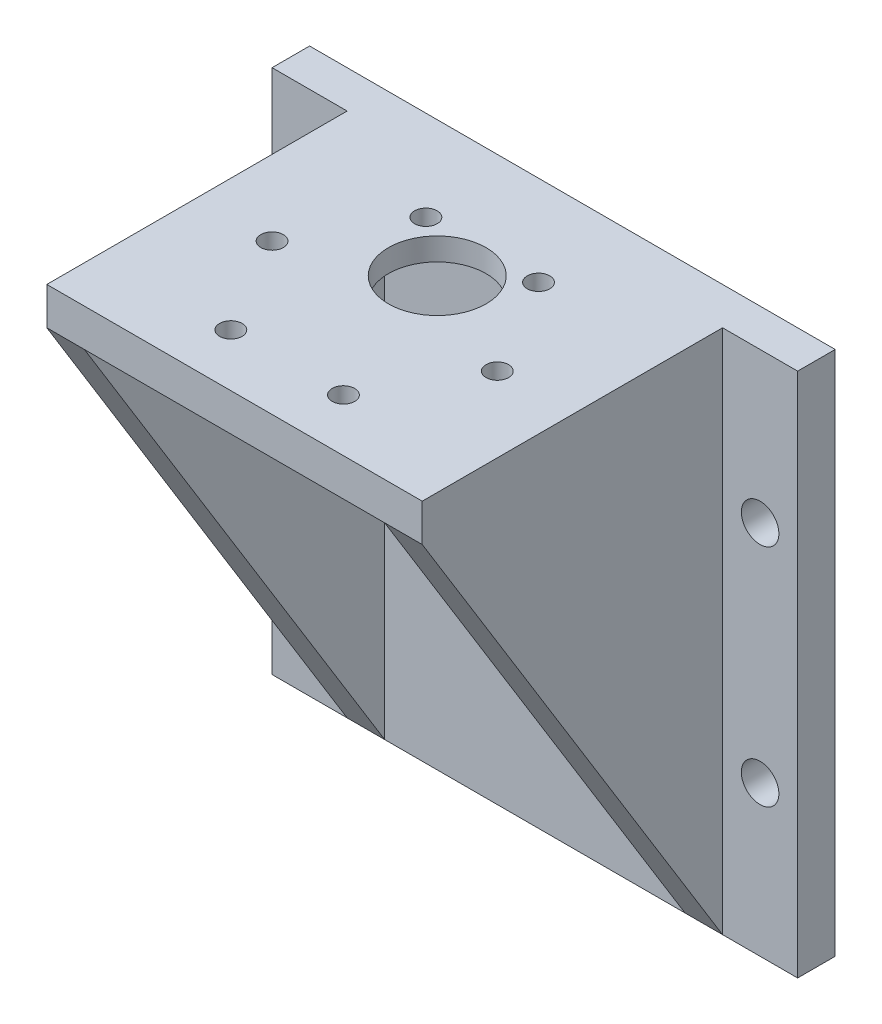
ISO-10303-21;
HEADER;
FILE_DESCRIPTION(('STEP AP214'),'2;1');
FILE_NAME('part.step','',(''),(''),'','','');
FILE_SCHEMA(('AUTOMOTIVE_DESIGN { 1 0 10303 214 1 1 1 1 }'));
ENDSEC;
DATA;
#1=APPLICATION_CONTEXT('core data for automotive mechanical design processes');
#2=APPLICATION_PROTOCOL_DEFINITION('international standard','automotive_design',2000,#1);
#3=PRODUCT_CONTEXT('',#1,'mechanical');
#4=PRODUCT('Part','Part','',(#3));
#5=PRODUCT_RELATED_PRODUCT_CATEGORY('part','',(#4));
#6=PRODUCT_DEFINITION_FORMATION('','',#4);
#7=PRODUCT_DEFINITION_CONTEXT('part definition',#1,'design');
#8=PRODUCT_DEFINITION('design','',#6,#7);
#9=PRODUCT_DEFINITION_SHAPE('','',#8);
#10=(LENGTH_UNIT() NAMED_UNIT(*) SI_UNIT(.MILLI.,.METRE.));
#11=(NAMED_UNIT(*) PLANE_ANGLE_UNIT() SI_UNIT($,.RADIAN.));
#12=(NAMED_UNIT(*) SI_UNIT($,.STERADIAN.) SOLID_ANGLE_UNIT());
#13=UNCERTAINTY_MEASURE_WITH_UNIT(LENGTH_MEASURE(1.E-05),#10,'distance_accuracy_value','');
#14=(GEOMETRIC_REPRESENTATION_CONTEXT(3) GLOBAL_UNCERTAINTY_ASSIGNED_CONTEXT((#13)) GLOBAL_UNIT_ASSIGNED_CONTEXT((#10,
#11,#12)) REPRESENTATION_CONTEXT('',''));
#15=CARTESIAN_POINT('',(0.,0.,0.));
#16=DIRECTION('',(0.,0.,1.));
#17=DIRECTION('',(1.,0.,0.));
#18=AXIS2_PLACEMENT_3D('',#15,#16,#17);
#19=CARTESIAN_POINT('',(0.,0.,5.));
#20=DIRECTION('',(0.,0.,1.));
#21=DIRECTION('',(1.,0.,0.));
#22=AXIS2_PLACEMENT_3D('',#19,#20,#21);
#23=PLANE('',#22);
#24=CARTESIAN_POINT('',(-41.7148673452362,-16.7230769230769,5.));
#25=DIRECTION('',(0.,0.,1.));
#26=DIRECTION('',(1.,0.,0.));
#27=AXIS2_PLACEMENT_3D('',#24,#25,#26);
#28=CIRCLE('',#27,2.49999999999999);
#29=CARTESIAN_POINT('',(-39.2148673452362,-16.7230769230769,5.));
#30=VERTEX_POINT('',#29);
#31=EDGE_CURVE('E187',#30,#30,#28,.T.);
#32=ORIENTED_EDGE('',*,*,#31,.F.);
#33=EDGE_LOOP('',(#32));
#34=FACE_BOUND('',#33,.T.);
#35=CARTESIAN_POINT('',(-41.7148673452362,13.2769230769231,5.));
#36=DIRECTION('',(0.,0.,1.));
#37=DIRECTION('',(1.,0.,0.));
#38=AXIS2_PLACEMENT_3D('',#35,#36,#37);
#39=CIRCLE('',#38,2.5);
#40=CARTESIAN_POINT('',(-39.2148673452362,13.2769230769231,5.));
#41=VERTEX_POINT('',#40);
#42=EDGE_CURVE('E181',#41,#41,#39,.T.);
#43=ORIENTED_EDGE('',*,*,#42,.F.);
#44=EDGE_LOOP('',(#43));
#45=FACE_BOUND('',#44,.T.);
#46=DIRECTION('',(0.,-1.,0.));
#47=VECTOR('',#46,1.);
#48=CARTESIAN_POINT('',(-36.7148673452362,-36.7230769230769,5.));
#49=LINE('',#48,#47);
#50=CARTESIAN_POINT('',(-36.7148673452362,33.2769230769231,5.));
#51=VERTEX_POINT('',#50);
#52=CARTESIAN_POINT('',(-36.7148673452362,-36.7230769230769,5.00000000000001));
#53=VERTEX_POINT('',#52);
#54=EDGE_CURVE('E133',#51,#53,#49,.T.);
#55=ORIENTED_EDGE('',*,*,#54,.F.);
#56=DIRECTION('',(-1.,0.,0.));
#57=VECTOR('',#56,1.);
#58=CARTESIAN_POINT('',(-46.7148673452362,33.2769230769231,5.));
#59=LINE('',#58,#57);
#60=CARTESIAN_POINT('',(-46.7148673452362,33.2769230769231,5.));
#61=VERTEX_POINT('',#60);
#62=EDGE_CURVE('E338',#51,#61,#59,.T.);
#63=ORIENTED_EDGE('',*,*,#62,.T.);
#64=DIRECTION('',(0.,-1.,0.));
#65=VECTOR('',#64,1.);
#66=CARTESIAN_POINT('',(-46.7148673452362,33.2769230769231,5.));
#67=LINE('',#66,#65);
#68=CARTESIAN_POINT('',(-46.7148673452361,-36.7230769230769,5.));
#69=VERTEX_POINT('',#68);
#70=EDGE_CURVE('E300',#61,#69,#67,.T.);
#71=ORIENTED_EDGE('',*,*,#70,.T.);
#72=DIRECTION('',(1.,0.,0.));
#73=VECTOR('',#72,1.);
#74=CARTESIAN_POINT('',(-46.7148673452361,-36.7230769230769,5.));
#75=LINE('',#74,#73);
#76=EDGE_CURVE('E315',#69,#53,#75,.T.);
#77=ORIENTED_EDGE('',*,*,#76,.T.);
#78=EDGE_LOOP('',(#55,#63,#71,#77));
#79=FACE_BOUND('',#78,.T.);
#80=ADVANCED_FACE('F33',(#34,#45,#79),#23,.T.);
#81=CARTESIAN_POINT('',(18.2851326547639,13.2769230769231,5.));
#82=DIRECTION('',(0.,0.,1.));
#83=DIRECTION('',(1.,0.,0.));
#84=AXIS2_PLACEMENT_3D('',#81,#82,#83);
#85=CIRCLE('',#84,2.5);
#86=CARTESIAN_POINT('',(20.7851326547639,13.2769230769231,5.));
#87=VERTEX_POINT('',#86);
#88=EDGE_CURVE('E199',#87,#87,#85,.T.);
#89=ORIENTED_EDGE('',*,*,#88,.F.);
#90=EDGE_LOOP('',(#89));
#91=FACE_BOUND('',#90,.T.);
#92=CARTESIAN_POINT('',(18.2851326547639,-16.7230769230769,5.));
#93=DIRECTION('',(0.,0.,1.));
#94=DIRECTION('',(1.,0.,0.));
#95=AXIS2_PLACEMENT_3D('',#92,#93,#94);
#96=CIRCLE('',#95,2.5);
#97=CARTESIAN_POINT('',(20.7851326547639,-16.7230769230769,5.));
#98=VERTEX_POINT('',#97);
#99=EDGE_CURVE('E193',#98,#98,#96,.T.);
#100=ORIENTED_EDGE('',*,*,#99,.F.);
#101=EDGE_LOOP('',(#100));
#102=FACE_BOUND('',#101,.T.);
#103=DIRECTION('',(0.,1.,0.));
#104=VECTOR('',#103,1.);
#105=CARTESIAN_POINT('',(13.2851326547639,33.2769230769231,5.));
#106=LINE('',#105,#104);
#107=CARTESIAN_POINT('',(13.2851326547639,-36.7230769230769,5.00000000000001));
#108=VERTEX_POINT('',#107);
#109=CARTESIAN_POINT('',(13.2851326547639,33.2769230769231,5.));
#110=VERTEX_POINT('',#109);
#111=EDGE_CURVE('E157',#108,#110,#106,.T.);
#112=ORIENTED_EDGE('',*,*,#111,.F.);
#113=CARTESIAN_POINT('',(23.2851326547639,-36.7230769230769,5.));
#114=VERTEX_POINT('',#113);
#115=EDGE_CURVE('E303',#108,#114,#75,.T.);
#116=ORIENTED_EDGE('',*,*,#115,.T.);
#117=DIRECTION('',(0.,1.,0.));
#118=VECTOR('',#117,1.);
#119=CARTESIAN_POINT('',(23.2851326547639,33.2769230769231,5.));
#120=LINE('',#119,#118);
#121=CARTESIAN_POINT('',(23.2851326547639,33.2769230769231,5.));
#122=VERTEX_POINT('',#121);
#123=EDGE_CURVE('E307',#114,#122,#120,.T.);
#124=ORIENTED_EDGE('',*,*,#123,.T.);
#125=EDGE_CURVE('E339',#122,#110,#59,.T.);
#126=ORIENTED_EDGE('',*,*,#125,.T.);
#127=EDGE_LOOP('',(#112,#116,#124,#126));
#128=FACE_BOUND('',#127,.T.);
#129=ADVANCED_FACE('F323',(#91,#102,#128),#23,.T.);
#130=CARTESIAN_POINT('',(-46.7148673452362,33.2769230769231,5.));
#131=DIRECTION('',(1.,0.,0.));
#132=DIRECTION('',(0.,1.,0.));
#133=AXIS2_PLACEMENT_3D('',#130,#131,#132);
#134=PLANE('',#133);
#135=DIRECTION('',(0.,-1.,0.));
#136=VECTOR('',#135,1.);
#137=CARTESIAN_POINT('',(-46.7148673452362,33.2769230769231,0.));
#138=LINE('',#137,#136);
#139=CARTESIAN_POINT('',(-46.7148673452362,33.2769230769231,0.));
#140=VERTEX_POINT('',#139);
#141=CARTESIAN_POINT('',(-46.7148673452361,-36.7230769230769,0.));
#142=VERTEX_POINT('',#141);
#143=EDGE_CURVE('E295',#140,#142,#138,.T.);
#144=ORIENTED_EDGE('',*,*,#143,.T.);
#145=DIRECTION('',(0.,0.,-1.));
#146=VECTOR('',#145,1.);
#147=CARTESIAN_POINT('',(-46.7148673452361,-36.7230769230769,5.));
#148=LINE('',#147,#146);
#149=EDGE_CURVE('E42',#69,#142,#148,.T.);
#150=ORIENTED_EDGE('',*,*,#149,.F.);
#151=ORIENTED_EDGE('',*,*,#70,.F.);
#152=DIRECTION('',(0.,0.,-1.));
#153=VECTOR('',#152,1.);
#154=CARTESIAN_POINT('',(-46.7148673452362,33.2769230769231,5.));
#155=LINE('',#154,#153);
#156=EDGE_CURVE('E344',#61,#140,#155,.T.);
#157=ORIENTED_EDGE('',*,*,#156,.T.);
#158=EDGE_LOOP('',(#144,#150,#151,#157));
#159=FACE_BOUND('',#158,.T.);
#160=ADVANCED_FACE('F35',(#159),#134,.F.);
#161=CARTESIAN_POINT('',(-46.7148673452361,-36.7230769230769,5.));
#162=DIRECTION('',(0.,1.,0.));
#163=DIRECTION('',(0.,0.,1.));
#164=AXIS2_PLACEMENT_3D('',#161,#162,#163);
#165=PLANE('',#164);
#166=ORIENTED_EDGE('',*,*,#115,.F.);
#167=DIRECTION('',(-1.,0.,0.));
#168=VECTOR('',#167,1.);
#169=CARTESIAN_POINT('',(89.6068202671326,-36.7230769230769,5.00000000000001));
#170=LINE('',#169,#168);
#171=CARTESIAN_POINT('',(8.28513265476387,-36.7230769230769,5.00000000000001));
#172=VERTEX_POINT('',#171);
#173=EDGE_CURVE('E163',#108,#172,#170,.T.);
#174=ORIENTED_EDGE('',*,*,#173,.T.);
#175=CARTESIAN_POINT('',(-31.7148673452362,-36.7230769230769,5.00000000000001));
#176=VERTEX_POINT('',#175);
#177=EDGE_CURVE('E318',#176,#172,#75,.T.);
#178=ORIENTED_EDGE('',*,*,#177,.F.);
#179=EDGE_CURVE('E168',#176,#53,#170,.T.);
#180=ORIENTED_EDGE('',*,*,#179,.T.);
#181=ORIENTED_EDGE('',*,*,#76,.F.);
#182=ORIENTED_EDGE('',*,*,#149,.T.);
#183=DIRECTION('',(1.,0.,0.));
#184=VECTOR('',#183,1.);
#185=CARTESIAN_POINT('',(-46.7148673452361,-36.7230769230769,0.));
#186=LINE('',#185,#184);
#187=CARTESIAN_POINT('',(23.2851326547639,-36.7230769230769,0.));
#188=VERTEX_POINT('',#187);
#189=EDGE_CURVE('E331',#142,#188,#186,.T.);
#190=ORIENTED_EDGE('',*,*,#189,.T.);
#191=DIRECTION('',(0.,0.,-1.));
#192=VECTOR('',#191,1.);
#193=CARTESIAN_POINT('',(23.2851326547639,-36.7230769230769,5.));
#194=LINE('',#193,#192);
#195=EDGE_CURVE('E328',#114,#188,#194,.T.);
#196=ORIENTED_EDGE('',*,*,#195,.F.);
#197=EDGE_LOOP('',(#166,#174,#178,#180,#181,#182,#190,#196));
#198=FACE_BOUND('',#197,.T.);
#199=ADVANCED_FACE('F329',(#198),#165,.F.);
#200=CARTESIAN_POINT('',(23.2851326547639,33.2769230769231,5.));
#201=DIRECTION('',(-1.,0.,0.));
#202=DIRECTION('',(0.,-1.,0.));
#203=AXIS2_PLACEMENT_3D('',#200,#201,#202);
#204=PLANE('',#203);
#205=DIRECTION('',(0.,1.,0.));
#206=VECTOR('',#205,1.);
#207=CARTESIAN_POINT('',(23.2851326547639,33.2769230769231,0.));
#208=LINE('',#207,#206);
#209=CARTESIAN_POINT('',(23.2851326547639,33.2769230769231,0.));
#210=VERTEX_POINT('',#209);
#211=EDGE_CURVE('E353',#188,#210,#208,.T.);
#212=ORIENTED_EDGE('',*,*,#211,.T.);
#213=DIRECTION('',(0.,0.,-1.));
#214=VECTOR('',#213,1.);
#215=CARTESIAN_POINT('',(23.2851326547639,33.2769230769231,5.));
#216=LINE('',#215,#214);
#217=EDGE_CURVE('E334',#122,#210,#216,.T.);
#218=ORIENTED_EDGE('',*,*,#217,.F.);
#219=ORIENTED_EDGE('',*,*,#123,.F.);
#220=ORIENTED_EDGE('',*,*,#195,.T.);
#221=EDGE_LOOP('',(#212,#218,#219,#220));
#222=FACE_BOUND('',#221,.T.);
#223=ADVANCED_FACE('F335',(#222),#204,.F.);
#224=CARTESIAN_POINT('',(-46.7148673452362,33.2769230769231,5.));
#225=DIRECTION('',(0.,-1.,0.));
#226=DIRECTION('',(0.,0.,-1.));
#227=AXIS2_PLACEMENT_3D('',#224,#225,#226);
#228=PLANE('',#227);
#229=CARTESIAN_POINT('',(-19.2148673452363,33.2769230769231,37.9903810567665));
#230=DIRECTION('',(0.,-1.,0.));
#231=DIRECTION('',(0.,0.,-1.));
#232=AXIS2_PLACEMENT_3D('',#229,#230,#231);
#233=CIRCLE('',#232,1.5);
#234=CARTESIAN_POINT('',(-19.2148673452363,33.2769230769231,36.4903810567665));
#235=VERTEX_POINT('',#234);
#236=EDGE_CURVE('E244',#235,#235,#233,.F.);
#237=ORIENTED_EDGE('',*,*,#236,.F.);
#238=EDGE_LOOP('',(#237));
#239=FACE_BOUND('',#238,.T.);
#240=CARTESIAN_POINT('',(-4.21486734523628,33.2769230769231,37.9903810567667));
#241=DIRECTION('',(0.,-1.,0.));
#242=DIRECTION('',(0.,0.,-1.));
#243=AXIS2_PLACEMENT_3D('',#240,#241,#242);
#244=CIRCLE('',#243,1.5);
#245=CARTESIAN_POINT('',(-4.21486734523628,33.2769230769231,36.4903810567667));
#246=VERTEX_POINT('',#245);
#247=EDGE_CURVE('E238',#246,#246,#244,.F.);
#248=ORIENTED_EDGE('',*,*,#247,.F.);
#249=EDGE_LOOP('',(#248));
#250=FACE_BOUND('',#249,.T.);
#251=CARTESIAN_POINT('',(3.28513265476384,33.2769230769231,25.));
#252=DIRECTION('',(0.,-1.,0.));
#253=DIRECTION('',(0.,0.,-1.));
#254=AXIS2_PLACEMENT_3D('',#251,#252,#253);
#255=CIRCLE('',#254,1.5);
#256=CARTESIAN_POINT('',(3.28513265476384,33.2769230769231,23.5));
#257=VERTEX_POINT('',#256);
#258=EDGE_CURVE('E232',#257,#257,#255,.F.);
#259=ORIENTED_EDGE('',*,*,#258,.F.);
#260=EDGE_LOOP('',(#259));
#261=FACE_BOUND('',#260,.T.);
#262=CARTESIAN_POINT('',(-4.2148673452361,33.2769230769231,12.0096189432334));
#263=DIRECTION('',(0.,-1.,0.));
#264=DIRECTION('',(0.,0.,-1.));
#265=AXIS2_PLACEMENT_3D('',#262,#263,#264);
#266=CIRCLE('',#265,1.5);
#267=CARTESIAN_POINT('',(-4.2148673452361,33.2769230769231,10.5096189432334));
#268=VERTEX_POINT('',#267);
#269=EDGE_CURVE('E226',#268,#268,#266,.F.);
#270=ORIENTED_EDGE('',*,*,#269,.F.);
#271=EDGE_LOOP('',(#270));
#272=FACE_BOUND('',#271,.T.);
#273=CARTESIAN_POINT('',(-19.2148673452361,33.2769230769231,12.0096189432334));
#274=DIRECTION('',(0.,-1.,0.));
#275=DIRECTION('',(0.,0.,-1.));
#276=AXIS2_PLACEMENT_3D('',#273,#274,#275);
#277=CIRCLE('',#276,1.5);
#278=CARTESIAN_POINT('',(-19.2148673452361,33.2769230769231,10.5096189432334));
#279=VERTEX_POINT('',#278);
#280=EDGE_CURVE('E220',#279,#279,#277,.F.);
#281=ORIENTED_EDGE('',*,*,#280,.F.);
#282=EDGE_LOOP('',(#281));
#283=FACE_BOUND('',#282,.T.);
#284=CARTESIAN_POINT('',(-26.7148673452362,33.2769230769231,25.));
#285=DIRECTION('',(0.,-1.,0.));
#286=DIRECTION('',(0.,0.,-1.));
#287=AXIS2_PLACEMENT_3D('',#284,#285,#286);
#288=CIRCLE('',#287,1.5);
#289=CARTESIAN_POINT('',(-26.7148673452362,33.2769230769231,23.5));
#290=VERTEX_POINT('',#289);
#291=EDGE_CURVE('E214',#290,#290,#288,.F.);
#292=ORIENTED_EDGE('',*,*,#291,.F.);
#293=EDGE_LOOP('',(#292));
#294=FACE_BOUND('',#293,.T.);
#295=CARTESIAN_POINT('',(-11.7148673452362,33.2769230769231,18.));
#296=DIRECTION('',(0.,-1.,0.));
#297=DIRECTION('',(0.,0.,-1.));
#298=AXIS2_PLACEMENT_3D('',#295,#296,#297);
#299=CIRCLE('',#298,6.5);
#300=CARTESIAN_POINT('',(-11.7148673452362,33.2769230769231,11.5));
#301=VERTEX_POINT('',#300);
#302=EDGE_CURVE('E206',#301,#301,#299,.F.);
#303=ORIENTED_EDGE('',*,*,#302,.F.);
#304=EDGE_LOOP('',(#303));
#305=FACE_BOUND('',#304,.T.);
#306=DIRECTION('',(-1.,0.,0.));
#307=VECTOR('',#306,1.);
#308=CARTESIAN_POINT('',(-46.7148673452362,33.2769230769231,0.));
#309=LINE('',#308,#307);
#310=EDGE_CURVE('E304',#210,#140,#309,.T.);
#311=ORIENTED_EDGE('',*,*,#310,.T.);
#312=ORIENTED_EDGE('',*,*,#156,.F.);
#313=ORIENTED_EDGE('',*,*,#62,.F.);
#314=DIRECTION('',(0.,0.,-1.));
#315=VECTOR('',#314,1.);
#316=CARTESIAN_POINT('',(-36.7148673452362,33.2769230769231,45.));
#317=LINE('',#316,#315);
#318=CARTESIAN_POINT('',(-36.7148673452362,33.2769230769231,45.));
#319=VERTEX_POINT('',#318);
#320=EDGE_CURVE('E140',#319,#51,#317,.T.);
#321=ORIENTED_EDGE('',*,*,#320,.F.);
#322=DIRECTION('',(-1.,0.,0.));
#323=VECTOR('',#322,1.);
#324=CARTESIAN_POINT('',(-36.7148673452362,33.2769230769231,45.));
#325=LINE('',#324,#323);
#326=CARTESIAN_POINT('',(13.2851326547639,33.2769230769231,45.));
#327=VERTEX_POINT('',#326);
#328=EDGE_CURVE('E138',#327,#319,#325,.T.);
#329=ORIENTED_EDGE('',*,*,#328,.F.);
#330=DIRECTION('',(0.,0.,-1.));
#331=VECTOR('',#330,1.);
#332=CARTESIAN_POINT('',(13.2851326547639,33.2769230769231,45.));
#333=LINE('',#332,#331);
#334=EDGE_CURVE('E142',#327,#110,#333,.T.);
#335=ORIENTED_EDGE('',*,*,#334,.T.);
#336=ORIENTED_EDGE('',*,*,#125,.F.);
#337=ORIENTED_EDGE('',*,*,#217,.T.);
#338=EDGE_LOOP('',(#311,#312,#313,#321,#329,#335,#336,#337));
#339=FACE_BOUND('',#338,.T.);
#340=ADVANCED_FACE('F360',(#239,#250,#261,#272,#283,#294,#305,#339),#228,.F.);
#341=DIRECTION('',(0.,-1.,0.));
#342=VECTOR('',#341,1.);
#343=CARTESIAN_POINT('',(8.28513265476387,-36.7230769230769,5.));
#344=LINE('',#343,#342);
#345=CARTESIAN_POINT('',(8.28513265476387,28.2769230769231,5.));
#346=VERTEX_POINT('',#345);
#347=EDGE_CURVE('E58',#346,#172,#344,.T.);
#348=ORIENTED_EDGE('',*,*,#347,.F.);
#349=DIRECTION('',(1.,0.,0.));
#350=VECTOR('',#349,1.);
#351=CARTESIAN_POINT('',(8.28513265476387,28.2769230769231,5.));
#352=LINE('',#351,#350);
#353=CARTESIAN_POINT('',(-31.7148673452362,28.2769230769231,5.));
#354=VERTEX_POINT('',#353);
#355=EDGE_CURVE('E148',#354,#346,#352,.T.);
#356=ORIENTED_EDGE('',*,*,#355,.F.);
#357=DIRECTION('',(0.,1.,0.));
#358=VECTOR('',#357,1.);
#359=CARTESIAN_POINT('',(-31.7148673452362,28.2769230769231,5.));
#360=LINE('',#359,#358);
#361=EDGE_CURVE('E150',#176,#354,#360,.T.);
#362=ORIENTED_EDGE('',*,*,#361,.F.);
#363=ORIENTED_EDGE('',*,*,#177,.T.);
#364=EDGE_LOOP('',(#348,#356,#362,#363));
#365=FACE_BOUND('',#364,.T.);
#366=ADVANCED_FACE('F384',(#365),#23,.T.);
#367=CARTESIAN_POINT('',(0.,0.,0.));
#368=DIRECTION('',(0.,0.,1.));
#369=DIRECTION('',(1.,0.,0.));
#370=AXIS2_PLACEMENT_3D('',#367,#368,#369);
#371=PLANE('',#370);
#372=CARTESIAN_POINT('',(18.2851326547639,13.2769230769231,0.));
#373=DIRECTION('',(0.,0.,1.));
#374=DIRECTION('',(1.,0.,0.));
#375=AXIS2_PLACEMENT_3D('',#372,#373,#374);
#376=CIRCLE('',#375,2.5);
#377=CARTESIAN_POINT('',(20.7851326547639,13.2769230769231,0.));
#378=VERTEX_POINT('',#377);
#379=EDGE_CURVE('E196',#378,#378,#376,.F.);
#380=ORIENTED_EDGE('',*,*,#379,.F.);
#381=EDGE_LOOP('',(#380));
#382=FACE_BOUND('',#381,.T.);
#383=CARTESIAN_POINT('',(18.2851326547639,-16.7230769230769,0.));
#384=DIRECTION('',(0.,0.,1.));
#385=DIRECTION('',(1.,0.,0.));
#386=AXIS2_PLACEMENT_3D('',#383,#384,#385);
#387=CIRCLE('',#386,2.5);
#388=CARTESIAN_POINT('',(20.7851326547639,-16.7230769230769,0.));
#389=VERTEX_POINT('',#388);
#390=EDGE_CURVE('E190',#389,#389,#387,.F.);
#391=ORIENTED_EDGE('',*,*,#390,.F.);
#392=EDGE_LOOP('',(#391));
#393=FACE_BOUND('',#392,.T.);
#394=CARTESIAN_POINT('',(-41.7148673452362,-16.7230769230769,0.));
#395=DIRECTION('',(0.,0.,1.));
#396=DIRECTION('',(1.,0.,0.));
#397=AXIS2_PLACEMENT_3D('',#394,#395,#396);
#398=CIRCLE('',#397,2.49999999999999);
#399=CARTESIAN_POINT('',(-39.2148673452362,-16.7230769230769,0.));
#400=VERTEX_POINT('',#399);
#401=EDGE_CURVE('E184',#400,#400,#398,.F.);
#402=ORIENTED_EDGE('',*,*,#401,.F.);
#403=EDGE_LOOP('',(#402));
#404=FACE_BOUND('',#403,.T.);
#405=CARTESIAN_POINT('',(-41.7148673452362,13.2769230769231,0.));
#406=DIRECTION('',(0.,0.,1.));
#407=DIRECTION('',(1.,0.,0.));
#408=AXIS2_PLACEMENT_3D('',#405,#406,#407);
#409=CIRCLE('',#408,2.5);
#410=CARTESIAN_POINT('',(-39.2148673452362,13.2769230769231,0.));
#411=VERTEX_POINT('',#410);
#412=EDGE_CURVE('E135',#411,#411,#409,.F.);
#413=ORIENTED_EDGE('',*,*,#412,.F.);
#414=EDGE_LOOP('',(#413));
#415=FACE_BOUND('',#414,.T.);
#416=ORIENTED_EDGE('',*,*,#143,.F.);
#417=ORIENTED_EDGE('',*,*,#310,.F.);
#418=ORIENTED_EDGE('',*,*,#211,.F.);
#419=ORIENTED_EDGE('',*,*,#189,.F.);
#420=EDGE_LOOP('',(#416,#417,#418,#419));
#421=FACE_BOUND('',#420,.T.);
#422=ADVANCED_FACE('F363',(#382,#393,#404,#415,#421),#371,.F.);
#423=CARTESIAN_POINT('',(-31.7148673452362,28.2769230769231,45.));
#424=DIRECTION('',(-1.,0.,0.));
#425=DIRECTION('',(0.,-1.,0.));
#426=AXIS2_PLACEMENT_3D('',#423,#424,#425);
#427=PLANE('',#426);
#428=DIRECTION('',(0.,0.,-1.));
#429=VECTOR('',#428,1.);
#430=CARTESIAN_POINT('',(-31.7148673452362,28.2769230769231,45.));
#431=LINE('',#430,#429);
#432=CARTESIAN_POINT('',(-31.7148673452362,28.2769230769231,45.));
#433=VERTEX_POINT('',#432);
#434=EDGE_CURVE('E290',#433,#354,#431,.T.);
#435=ORIENTED_EDGE('',*,*,#434,.F.);
#436=DIRECTION('',(0.,-0.851658316704544,-0.524097425664335));
#437=VECTOR('',#436,1.);
#438=CARTESIAN_POINT('',(-31.7148673452362,28.2769230769231,45.));
#439=LINE('',#438,#437);
#440=EDGE_CURVE('E122',#433,#176,#439,.T.);
#441=ORIENTED_EDGE('',*,*,#440,.T.);
#442=ORIENTED_EDGE('',*,*,#361,.T.);
#443=EDGE_LOOP('',(#435,#441,#442));
#444=FACE_BOUND('',#443,.T.);
#445=ADVANCED_FACE('F283',(#444),#427,.F.);
#446=CARTESIAN_POINT('',(8.28513265476387,28.2769230769231,45.));
#447=DIRECTION('',(0.,1.,0.));
#448=DIRECTION('',(-1.,0.,0.));
#449=AXIS2_PLACEMENT_3D('',#446,#447,#448);
#450=PLANE('',#449);
#451=CARTESIAN_POINT('',(-11.7148673452362,28.2769230769231,25.));
#452=DIRECTION('',(0.,-1.,0.));
#453=DIRECTION('',(1.,0.,0.));
#454=AXIS2_PLACEMENT_3D('',#451,#452,#453);
#455=CIRCLE('',#454,19.);
#456=CARTESIAN_POINT('',(7.28513265476383,28.2769230769231,25.));
#457=VERTEX_POINT('',#456);
#458=EDGE_CURVE('E203',#457,#457,#455,.T.);
#459=ORIENTED_EDGE('',*,*,#458,.F.);
#460=EDGE_LOOP('',(#459));
#461=FACE_BOUND('',#460,.T.);
#462=ORIENTED_EDGE('',*,*,#355,.T.);
#463=DIRECTION('',(0.,0.,-1.));
#464=VECTOR('',#463,1.);
#465=CARTESIAN_POINT('',(8.28513265476387,28.2769230769231,45.));
#466=LINE('',#465,#464);
#467=CARTESIAN_POINT('',(8.28513265476387,28.2769230769231,45.));
#468=VERTEX_POINT('',#467);
#469=EDGE_CURVE('E289',#468,#346,#466,.T.);
#470=ORIENTED_EDGE('',*,*,#469,.F.);
#471=DIRECTION('',(1.,0.,0.));
#472=VECTOR('',#471,1.);
#473=CARTESIAN_POINT('',(8.28513265476387,28.2769230769231,45.));
#474=LINE('',#473,#472);
#475=EDGE_CURVE('E372',#433,#468,#474,.T.);
#476=ORIENTED_EDGE('',*,*,#475,.F.);
#477=ORIENTED_EDGE('',*,*,#434,.T.);
#478=EDGE_LOOP('',(#462,#470,#476,#477));
#479=FACE_BOUND('',#478,.T.);
#480=ADVANCED_FACE('F279',(#461,#479),#450,.F.);
#481=CARTESIAN_POINT('',(8.28513265476387,-36.7230769230769,45.));
#482=DIRECTION('',(1.,0.,0.));
#483=DIRECTION('',(0.,1.,0.));
#484=AXIS2_PLACEMENT_3D('',#481,#482,#483);
#485=PLANE('',#484);
#486=ORIENTED_EDGE('',*,*,#347,.T.);
#487=DIRECTION('',(0.,0.851658316704544,0.524097425664335));
#488=VECTOR('',#487,1.);
#489=CARTESIAN_POINT('',(8.28513265476387,-18.868999669858,15.9871244635193));
#490=LINE('',#489,#488);
#491=EDGE_CURVE('E162',#172,#468,#490,.T.);
#492=ORIENTED_EDGE('',*,*,#491,.T.);
#493=ORIENTED_EDGE('',*,*,#469,.T.);
#494=EDGE_LOOP('',(#486,#492,#493));
#495=FACE_BOUND('',#494,.T.);
#496=ADVANCED_FACE('F282',(#495),#485,.F.);
#497=CARTESIAN_POINT('',(13.2851326547639,33.2769230769231,45.));
#498=DIRECTION('',(-1.,0.,0.));
#499=DIRECTION('',(0.,-1.,0.));
#500=AXIS2_PLACEMENT_3D('',#497,#498,#499);
#501=PLANE('',#500);
#502=DIRECTION('',(0.,1.,0.));
#503=VECTOR('',#502,1.);
#504=CARTESIAN_POINT('',(13.2851326547639,33.2769230769231,45.));
#505=LINE('',#504,#503);
#506=CARTESIAN_POINT('',(13.2851326547639,28.2769230769231,45.));
#507=VERTEX_POINT('',#506);
#508=EDGE_CURVE('E144',#507,#327,#505,.T.);
#509=ORIENTED_EDGE('',*,*,#508,.F.);
#510=DIRECTION('',(0.,0.851658316704544,0.524097425664335));
#511=VECTOR('',#510,1.);
#512=CARTESIAN_POINT('',(13.2851326547639,28.2769230769231,45.));
#513=LINE('',#512,#511);
#514=EDGE_CURVE('E50',#108,#507,#513,.T.);
#515=ORIENTED_EDGE('',*,*,#514,.F.);
#516=ORIENTED_EDGE('',*,*,#111,.T.);
#517=ORIENTED_EDGE('',*,*,#334,.F.);
#518=EDGE_LOOP('',(#509,#515,#516,#517));
#519=FACE_BOUND('',#518,.T.);
#520=ADVANCED_FACE('F370',(#519),#501,.F.);
#521=CARTESIAN_POINT('',(-36.7148673452362,-36.7230769230769,45.));
#522=DIRECTION('',(1.,0.,0.));
#523=DIRECTION('',(0.,1.,0.));
#524=AXIS2_PLACEMENT_3D('',#521,#522,#523);
#525=PLANE('',#524);
#526=ORIENTED_EDGE('',*,*,#54,.T.);
#527=DIRECTION('',(0.,-0.851658316704544,-0.524097425664334));
#528=VECTOR('',#527,1.);
#529=CARTESIAN_POINT('',(-36.7148673452362,28.2769230769231,45.));
#530=LINE('',#529,#528);
#531=CARTESIAN_POINT('',(-36.7148673452362,28.2769230769231,45.));
#532=VERTEX_POINT('',#531);
#533=EDGE_CURVE('E119',#532,#53,#530,.T.);
#534=ORIENTED_EDGE('',*,*,#533,.F.);
#535=DIRECTION('',(0.,-1.,0.));
#536=VECTOR('',#535,1.);
#537=CARTESIAN_POINT('',(-36.7148673452362,-36.7230769230769,45.));
#538=LINE('',#537,#536);
#539=EDGE_CURVE('E132',#319,#532,#538,.T.);
#540=ORIENTED_EDGE('',*,*,#539,.F.);
#541=ORIENTED_EDGE('',*,*,#320,.T.);
#542=EDGE_LOOP('',(#526,#534,#540,#541));
#543=FACE_BOUND('',#542,.T.);
#544=ADVANCED_FACE('F130',(#543),#525,.F.);
#545=CARTESIAN_POINT('',(0.,0.,45.));
#546=DIRECTION('',(0.,0.,-1.));
#547=DIRECTION('',(-1.,0.,0.));
#548=AXIS2_PLACEMENT_3D('',#545,#546,#547);
#549=PLANE('',#548);
#550=ORIENTED_EDGE('',*,*,#539,.T.);
#551=DIRECTION('',(1.,0.,0.));
#552=VECTOR('',#551,1.);
#553=CARTESIAN_POINT('',(0.,28.2769230769231,45.));
#554=LINE('',#553,#552);
#555=EDGE_CURVE('E11',#532,#433,#554,.T.);
#556=ORIENTED_EDGE('',*,*,#555,.T.);
#557=ORIENTED_EDGE('',*,*,#475,.T.);
#558=DIRECTION('',(-1.,0.,0.));
#559=VECTOR('',#558,1.);
#560=CARTESIAN_POINT('',(89.6068202671326,28.2769230769231,45.));
#561=LINE('',#560,#559);
#562=EDGE_CURVE('E134',#507,#468,#561,.T.);
#563=ORIENTED_EDGE('',*,*,#562,.F.);
#564=ORIENTED_EDGE('',*,*,#508,.T.);
#565=ORIENTED_EDGE('',*,*,#328,.T.);
#566=EDGE_LOOP('',(#550,#556,#557,#563,#564,#565));
#567=FACE_BOUND('',#566,.T.);
#568=ADVANCED_FACE('F136',(#567),#549,.F.);
#569=CARTESIAN_POINT('',(89.6068202671326,28.2769230769231,45.));
#570=DIRECTION('',(0.,0.524097425664334,-0.851658316704544));
#571=DIRECTION('',(0.,0.851658316704544,0.524097425664335));
#572=AXIS2_PLACEMENT_3D('',#569,#570,#571);
#573=PLANE('',#572);
#574=ORIENTED_EDGE('',*,*,#173,.F.);
#575=ORIENTED_EDGE('',*,*,#514,.T.);
#576=ORIENTED_EDGE('',*,*,#562,.T.);
#577=ORIENTED_EDGE('',*,*,#491,.F.);
#578=EDGE_LOOP('',(#574,#575,#576,#577));
#579=FACE_BOUND('',#578,.T.);
#580=ADVANCED_FACE('F574',(#579),#573,.F.);
#581=ORIENTED_EDGE('',*,*,#555,.F.);
#582=ORIENTED_EDGE('',*,*,#533,.T.);
#583=ORIENTED_EDGE('',*,*,#179,.F.);
#584=ORIENTED_EDGE('',*,*,#440,.F.);
#585=EDGE_LOOP('',(#581,#582,#583,#584));
#586=FACE_BOUND('',#585,.T.);
#587=ADVANCED_FACE('F118',(#586),#573,.F.);
#588=CARTESIAN_POINT('',(-41.7148673452362,13.2769230769231,-7.07106781186548));
#589=DIRECTION('',(0.,0.,1.));
#590=DIRECTION('',(1.,0.,0.));
#591=AXIS2_PLACEMENT_3D('',#588,#589,#590);
#592=CYLINDRICAL_SURFACE('',#591,2.5);
#593=ORIENTED_EDGE('',*,*,#412,.T.);
#594=EDGE_LOOP('',(#593));
#595=FACE_BOUND('',#594,.T.);
#596=ORIENTED_EDGE('',*,*,#42,.T.);
#597=EDGE_LOOP('',(#596));
#598=FACE_BOUND('',#597,.T.);
#599=ADVANCED_FACE('F437',(#595,#598),#592,.F.);
#600=CARTESIAN_POINT('',(-41.7148673452362,-16.7230769230769,-7.07106781186548));
#601=DIRECTION('',(0.,0.,1.));
#602=DIRECTION('',(1.,0.,0.));
#603=AXIS2_PLACEMENT_3D('',#600,#601,#602);
#604=CYLINDRICAL_SURFACE('',#603,2.49999999999999);
#605=ORIENTED_EDGE('',*,*,#401,.T.);
#606=EDGE_LOOP('',(#605));
#607=FACE_BOUND('',#606,.T.);
#608=ORIENTED_EDGE('',*,*,#31,.T.);
#609=EDGE_LOOP('',(#608));
#610=FACE_BOUND('',#609,.T.);
#611=ADVANCED_FACE('F442',(#607,#610),#604,.F.);
#612=CARTESIAN_POINT('',(18.2851326547639,-16.7230769230769,-7.07106781186548));
#613=DIRECTION('',(0.,0.,1.));
#614=DIRECTION('',(1.,0.,0.));
#615=AXIS2_PLACEMENT_3D('',#612,#613,#614);
#616=CYLINDRICAL_SURFACE('',#615,2.5);
#617=ORIENTED_EDGE('',*,*,#390,.T.);
#618=EDGE_LOOP('',(#617));
#619=FACE_BOUND('',#618,.T.);
#620=ORIENTED_EDGE('',*,*,#99,.T.);
#621=EDGE_LOOP('',(#620));
#622=FACE_BOUND('',#621,.T.);
#623=ADVANCED_FACE('F454',(#619,#622),#616,.F.);
#624=CARTESIAN_POINT('',(18.2851326547639,13.2769230769231,-7.07106781186548));
#625=DIRECTION('',(0.,0.,1.));
#626=DIRECTION('',(1.,0.,0.));
#627=AXIS2_PLACEMENT_3D('',#624,#625,#626);
#628=CYLINDRICAL_SURFACE('',#627,2.5);
#629=ORIENTED_EDGE('',*,*,#379,.T.);
#630=EDGE_LOOP('',(#629));
#631=FACE_BOUND('',#630,.T.);
#632=ORIENTED_EDGE('',*,*,#88,.T.);
#633=EDGE_LOOP('',(#632));
#634=FACE_BOUND('',#633,.T.);
#635=ADVANCED_FACE('F275',(#631,#634),#628,.F.);
#636=CARTESIAN_POINT('',(-11.7148673452362,30.2769230769231,25.));
#637=DIRECTION('',(0.,-1.,0.));
#638=DIRECTION('',(1.,0.,0.));
#639=AXIS2_PLACEMENT_3D('',#636,#637,#638);
#640=CYLINDRICAL_SURFACE('',#639,19.);
#641=CARTESIAN_POINT('',(-11.7148673452362,30.2769230769231,25.));
#642=DIRECTION('',(0.,-1.,0.));
#643=DIRECTION('',(1.,0.,0.));
#644=AXIS2_PLACEMENT_3D('',#641,#642,#643);
#645=CIRCLE('',#644,19.);
#646=CARTESIAN_POINT('',(7.28513265476383,30.2769230769231,25.));
#647=VERTEX_POINT('',#646);
#648=EDGE_CURVE('E202',#647,#647,#645,.T.);
#649=ORIENTED_EDGE('',*,*,#648,.F.);
#650=EDGE_LOOP('',(#649));
#651=FACE_BOUND('',#650,.T.);
#652=ORIENTED_EDGE('',*,*,#458,.T.);
#653=EDGE_LOOP('',(#652));
#654=FACE_BOUND('',#653,.T.);
#655=ADVANCED_FACE('F257',(#651,#654),#640,.F.);
#656=CARTESIAN_POINT('',(-11.7148673452362,30.2769230769231,25.));
#657=DIRECTION('',(0.,-1.,0.));
#658=DIRECTION('',(1.,0.,0.));
#659=AXIS2_PLACEMENT_3D('',#656,#657,#658);
#660=PLANE('',#659);
#661=CARTESIAN_POINT('',(-19.2148673452363,30.2769230769231,37.9903810567665));
#662=DIRECTION('',(0.,-1.,0.));
#663=DIRECTION('',(0.50000000000001,0.,-0.866025403784433));
#664=AXIS2_PLACEMENT_3D('',#661,#662,#663);
#665=CIRCLE('',#664,1.5);
#666=CARTESIAN_POINT('',(-18.4648673452363,30.2769230769231,36.6913429510899));
#667=VERTEX_POINT('',#666);
#668=EDGE_CURVE('E247',#667,#667,#665,.T.);
#669=ORIENTED_EDGE('',*,*,#668,.F.);
#670=EDGE_LOOP('',(#669));
#671=FACE_BOUND('',#670,.T.);
#672=CARTESIAN_POINT('',(-4.21486734523628,30.2769230769231,37.9903810567667));
#673=DIRECTION('',(0.,-1.,0.));
#674=DIRECTION('',(-0.499999999999992,0.,-0.866025403784443));
#675=AXIS2_PLACEMENT_3D('',#672,#673,#674);
#676=CIRCLE('',#675,1.5);
#677=CARTESIAN_POINT('',(-4.96486734523627,30.2769230769231,36.69134295109));
#678=VERTEX_POINT('',#677);
#679=EDGE_CURVE('E241',#678,#678,#676,.T.);
#680=ORIENTED_EDGE('',*,*,#679,.F.);
#681=EDGE_LOOP('',(#680));
#682=FACE_BOUND('',#681,.T.);
#683=CARTESIAN_POINT('',(3.28513265476384,30.2769230769231,25.));
#684=DIRECTION('',(0.,-1.,0.));
#685=DIRECTION('',(-1.,0.,0.));
#686=AXIS2_PLACEMENT_3D('',#683,#684,#685);
#687=CIRCLE('',#686,1.5);
#688=CARTESIAN_POINT('',(1.78513265476384,30.2769230769231,25.));
#689=VERTEX_POINT('',#688);
#690=EDGE_CURVE('E235',#689,#689,#687,.T.);
#691=ORIENTED_EDGE('',*,*,#690,.F.);
#692=EDGE_LOOP('',(#691));
#693=FACE_BOUND('',#692,.T.);
#694=CARTESIAN_POINT('',(-4.2148673452361,30.2769230769231,12.0096189432334));
#695=DIRECTION('',(0.,-1.,0.));
#696=DIRECTION('',(-0.500000000000004,0.,0.866025403784436));
#697=AXIS2_PLACEMENT_3D('',#694,#695,#696);
#698=CIRCLE('',#697,1.5);
#699=CARTESIAN_POINT('',(-4.96486734523611,30.2769230769231,13.3086570489101));
#700=VERTEX_POINT('',#699);
#701=EDGE_CURVE('E229',#700,#700,#698,.T.);
#702=ORIENTED_EDGE('',*,*,#701,.F.);
#703=EDGE_LOOP('',(#702));
#704=FACE_BOUND('',#703,.T.);
#705=CARTESIAN_POINT('',(-19.2148673452361,30.2769230769231,12.0096189432334));
#706=DIRECTION('',(0.,-1.,0.));
#707=DIRECTION('',(0.499999999999998,0.,0.86602540378444));
#708=AXIS2_PLACEMENT_3D('',#705,#706,#707);
#709=CIRCLE('',#708,1.5);
#710=CARTESIAN_POINT('',(-18.4648673452361,30.2769230769231,13.3086570489101));
#711=VERTEX_POINT('',#710);
#712=EDGE_CURVE('E223',#711,#711,#709,.T.);
#713=ORIENTED_EDGE('',*,*,#712,.F.);
#714=EDGE_LOOP('',(#713));
#715=FACE_BOUND('',#714,.T.);
#716=CARTESIAN_POINT('',(-26.7148673452362,30.2769230769231,25.));
#717=DIRECTION('',(0.,-1.,0.));
#718=DIRECTION('',(1.,0.,0.));
#719=AXIS2_PLACEMENT_3D('',#716,#717,#718);
#720=CIRCLE('',#719,1.5);
#721=CARTESIAN_POINT('',(-25.2148673452362,30.2769230769231,25.));
#722=VERTEX_POINT('',#721);
#723=EDGE_CURVE('E217',#722,#722,#720,.T.);
#724=ORIENTED_EDGE('',*,*,#723,.F.);
#725=EDGE_LOOP('',(#724));
#726=FACE_BOUND('',#725,.T.);
#727=CARTESIAN_POINT('',(-11.7148673452362,30.2769230769231,18.));
#728=DIRECTION('',(0.,-1.,0.));
#729=DIRECTION('',(1.,0.,0.));
#730=AXIS2_PLACEMENT_3D('',#727,#728,#729);
#731=CIRCLE('',#730,6.5);
#732=CARTESIAN_POINT('',(-5.21486734523617,30.2769230769231,18.));
#733=VERTEX_POINT('',#732);
#734=EDGE_CURVE('E211',#733,#733,#731,.T.);
#735=ORIENTED_EDGE('',*,*,#734,.F.);
#736=EDGE_LOOP('',(#735));
#737=FACE_BOUND('',#736,.T.);
#738=ORIENTED_EDGE('',*,*,#648,.T.);
#739=EDGE_LOOP('',(#738));
#740=FACE_BOUND('',#739,.T.);
#741=ADVANCED_FACE('F253',(#671,#682,#693,#704,#715,#726,#737,#740),#660,.T.);
#742=CARTESIAN_POINT('',(-11.7148673452362,51.6616993877733,18.));
#743=DIRECTION('',(0.,-1.,0.));
#744=DIRECTION('',(1.,0.,0.));
#745=AXIS2_PLACEMENT_3D('',#742,#743,#744);
#746=CYLINDRICAL_SURFACE('',#745,6.5);
#747=ORIENTED_EDGE('',*,*,#302,.T.);
#748=EDGE_LOOP('',(#747));
#749=FACE_BOUND('',#748,.T.);
#750=ORIENTED_EDGE('',*,*,#734,.T.);
#751=EDGE_LOOP('',(#750));
#752=FACE_BOUND('',#751,.T.);
#753=ADVANCED_FACE('F256',(#749,#752),#746,.F.);
#754=CARTESIAN_POINT('',(-26.7148673452362,37.5195637640424,25.));
#755=DIRECTION('',(0.,-1.,0.));
#756=DIRECTION('',(1.,0.,0.));
#757=AXIS2_PLACEMENT_3D('',#754,#755,#756);
#758=CYLINDRICAL_SURFACE('',#757,1.5);
#759=ORIENTED_EDGE('',*,*,#291,.T.);
#760=EDGE_LOOP('',(#759));
#761=FACE_BOUND('',#760,.T.);
#762=ORIENTED_EDGE('',*,*,#723,.T.);
#763=EDGE_LOOP('',(#762));
#764=FACE_BOUND('',#763,.T.);
#765=ADVANCED_FACE('F498',(#761,#764),#758,.F.);
#766=CARTESIAN_POINT('',(-19.2148673452361,37.5195637640424,12.0096189432334));
#767=DIRECTION('',(0.,-1.,0.));
#768=DIRECTION('',(1.,0.,0.));
#769=AXIS2_PLACEMENT_3D('',#766,#767,#768);
#770=CYLINDRICAL_SURFACE('',#769,1.5);
#771=ORIENTED_EDGE('',*,*,#280,.T.);
#772=EDGE_LOOP('',(#771));
#773=FACE_BOUND('',#772,.T.);
#774=ORIENTED_EDGE('',*,*,#712,.T.);
#775=EDGE_LOOP('',(#774));
#776=FACE_BOUND('',#775,.T.);
#777=ADVANCED_FACE('F507',(#773,#776),#770,.F.);
#778=CARTESIAN_POINT('',(-4.21486734523611,37.5195637640424,12.0096189432334));
#779=DIRECTION('',(0.,-1.,0.));
#780=DIRECTION('',(1.,0.,0.));
#781=AXIS2_PLACEMENT_3D('',#778,#779,#780);
#782=CYLINDRICAL_SURFACE('',#781,1.5);
#783=ORIENTED_EDGE('',*,*,#269,.T.);
#784=EDGE_LOOP('',(#783));
#785=FACE_BOUND('',#784,.T.);
#786=ORIENTED_EDGE('',*,*,#701,.T.);
#787=EDGE_LOOP('',(#786));
#788=FACE_BOUND('',#787,.T.);
#789=ADVANCED_FACE('F529',(#785,#788),#782,.F.);
#790=CARTESIAN_POINT('',(3.28513265476384,37.5195637640424,25.));
#791=DIRECTION('',(0.,-1.,0.));
#792=DIRECTION('',(1.,0.,0.));
#793=AXIS2_PLACEMENT_3D('',#790,#791,#792);
#794=CYLINDRICAL_SURFACE('',#793,1.5);
#795=ORIENTED_EDGE('',*,*,#258,.T.);
#796=EDGE_LOOP('',(#795));
#797=FACE_BOUND('',#796,.T.);
#798=ORIENTED_EDGE('',*,*,#690,.T.);
#799=EDGE_LOOP('',(#798));
#800=FACE_BOUND('',#799,.T.);
#801=ADVANCED_FACE('F539',(#797,#800),#794,.F.);
#802=CARTESIAN_POINT('',(-4.21486734523628,37.5195637640424,37.9903810567667));
#803=DIRECTION('',(0.,-1.,0.));
#804=DIRECTION('',(1.,0.,0.));
#805=AXIS2_PLACEMENT_3D('',#802,#803,#804);
#806=CYLINDRICAL_SURFACE('',#805,1.5);
#807=ORIENTED_EDGE('',*,*,#247,.T.);
#808=EDGE_LOOP('',(#807));
#809=FACE_BOUND('',#808,.T.);
#810=ORIENTED_EDGE('',*,*,#679,.T.);
#811=EDGE_LOOP('',(#810));
#812=FACE_BOUND('',#811,.T.);
#813=ADVANCED_FACE('F549',(#809,#812),#806,.F.);
#814=CARTESIAN_POINT('',(-19.2148673452363,37.5195637640424,37.9903810567665));
#815=DIRECTION('',(0.,-1.,0.));
#816=DIRECTION('',(1.,0.,0.));
#817=AXIS2_PLACEMENT_3D('',#814,#815,#816);
#818=CYLINDRICAL_SURFACE('',#817,1.5);
#819=ORIENTED_EDGE('',*,*,#236,.T.);
#820=EDGE_LOOP('',(#819));
#821=FACE_BOUND('',#820,.T.);
#822=ORIENTED_EDGE('',*,*,#668,.T.);
#823=EDGE_LOOP('',(#822));
#824=FACE_BOUND('',#823,.T.);
#825=ADVANCED_FACE('F251',(#821,#824),#818,.F.);
#826=CLOSED_SHELL('',(#80,#129,#160,#199,#223,#340,#366,#422,#445,#480,#496,#520,#544,#568,#580,
#587,#599,#611,#623,#635,#655,#741,#753,#765,#777,#789,#801,#813,#825));
#827=MANIFOLD_SOLID_BREP('B2',#826);
#828=ADVANCED_BREP_SHAPE_REPRESENTATION('',(#18,#827),#14);
#829=SHAPE_DEFINITION_REPRESENTATION(#9,#828);
ENDSEC;
END-ISO-10303-21;
